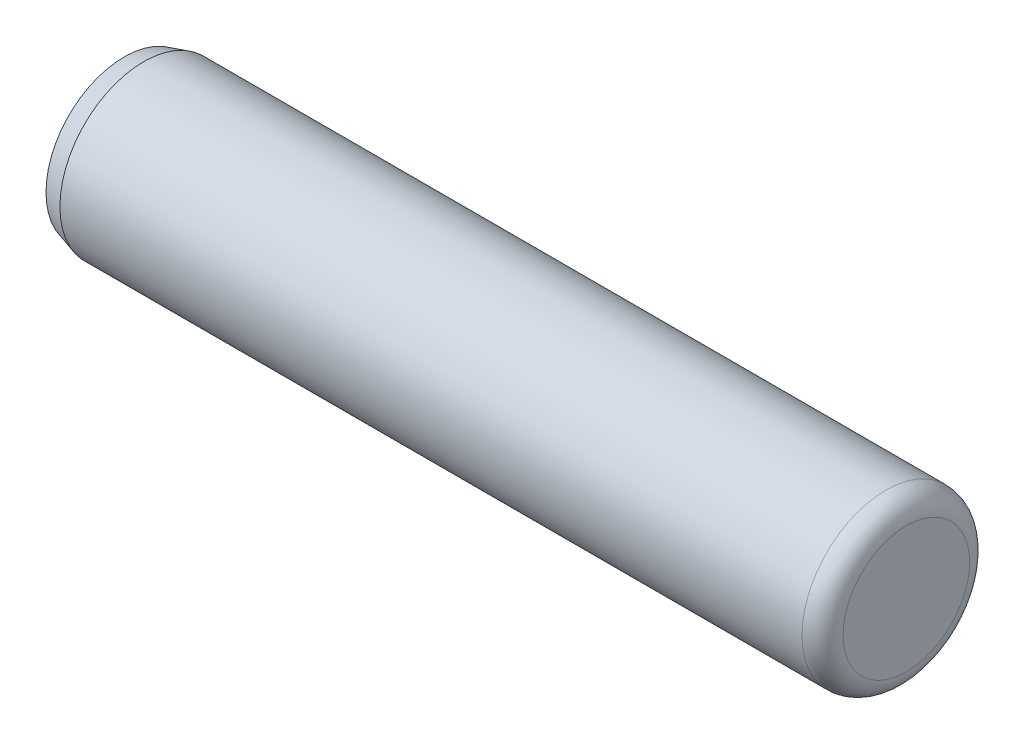
ISO-10303-21;
HEADER;
FILE_DESCRIPTION(('STEP AP214'),'2;1');
FILE_NAME('part.step','',(''),(''),'','','');
FILE_SCHEMA(('AUTOMOTIVE_DESIGN { 1 0 10303 214 1 1 1 1 }'));
ENDSEC;
DATA;
#1=APPLICATION_CONTEXT('core data for automotive mechanical design processes');
#2=APPLICATION_PROTOCOL_DEFINITION('international standard','automotive_design',2000,#1);
#3=PRODUCT_CONTEXT('',#1,'mechanical');
#4=PRODUCT('Part','Part','',(#3));
#5=PRODUCT_RELATED_PRODUCT_CATEGORY('part','',(#4));
#6=PRODUCT_DEFINITION_FORMATION('','',#4);
#7=PRODUCT_DEFINITION_CONTEXT('part definition',#1,'design');
#8=PRODUCT_DEFINITION('design','',#6,#7);
#9=PRODUCT_DEFINITION_SHAPE('','',#8);
#10=(LENGTH_UNIT() NAMED_UNIT(*) SI_UNIT(.MILLI.,.METRE.));
#11=(NAMED_UNIT(*) PLANE_ANGLE_UNIT() SI_UNIT($,.RADIAN.));
#12=(NAMED_UNIT(*) SI_UNIT($,.STERADIAN.) SOLID_ANGLE_UNIT());
#13=UNCERTAINTY_MEASURE_WITH_UNIT(LENGTH_MEASURE(1.E-05),#10,'distance_accuracy_value','');
#14=(GEOMETRIC_REPRESENTATION_CONTEXT(3) GLOBAL_UNCERTAINTY_ASSIGNED_CONTEXT((#13)) GLOBAL_UNIT_ASSIGNED_CONTEXT((#10,
#11,#12)) REPRESENTATION_CONTEXT('',''));
#15=CARTESIAN_POINT('',(0.,0.,0.));
#16=DIRECTION('',(0.,0.,1.));
#17=DIRECTION('',(1.,0.,0.));
#18=AXIS2_PLACEMENT_3D('',#15,#16,#17);
#19=CARTESIAN_POINT('',(10.5283,0.,0.));
#20=DIRECTION('',(-1.,0.,0.));
#21=DIRECTION('',(0.,0.,1.));
#22=AXIS2_PLACEMENT_3D('',#19,#20,#21);
#23=TOROIDAL_SURFACE('',#22,1.79705,0.5842);
#24=CARTESIAN_POINT('',(10.5283,0.,0.));
#25=DIRECTION('',(-1.,0.,0.));
#26=DIRECTION('',(0.,0.,1.));
#27=AXIS2_PLACEMENT_3D('',#24,#25,#26);
#28=CIRCLE('',#27,2.38125);
#29=CARTESIAN_POINT('',(10.5283,0.,2.38125));
#30=VERTEX_POINT('',#29);
#31=EDGE_CURVE('E10',#30,#30,#28,.T.);
#32=ORIENTED_EDGE('',*,*,#31,.F.);
#33=EDGE_LOOP('',(#32));
#34=FACE_BOUND('',#33,.T.);
#35=CARTESIAN_POINT('',(11.1125,0.,0.));
#36=DIRECTION('',(-1.,0.,0.));
#37=DIRECTION('',(0.,0.,1.));
#38=AXIS2_PLACEMENT_3D('',#35,#36,#37);
#39=CIRCLE('',#38,1.79705);
#40=CARTESIAN_POINT('',(11.1125,0.,1.79705));
#41=VERTEX_POINT('',#40);
#42=EDGE_CURVE('E46',#41,#41,#39,.T.);
#43=ORIENTED_EDGE('',*,*,#42,.T.);
#44=EDGE_LOOP('',(#43));
#45=FACE_BOUND('',#44,.T.);
#46=ADVANCED_FACE('F32',(#34,#45),#23,.T.);
#47=CARTESIAN_POINT('',(-11.1125,0.,0.));
#48=DIRECTION('',(-1.,0.,0.));
#49=DIRECTION('',(0.,0.,1.));
#50=AXIS2_PLACEMENT_3D('',#47,#48,#49);
#51=CYLINDRICAL_SURFACE('',#50,2.38125);
#52=CARTESIAN_POINT('',(-10.5588729570403,0.,0.));
#53=DIRECTION('',(-1.,0.,0.));
#54=DIRECTION('',(0.,0.,1.));
#55=AXIS2_PLACEMENT_3D('',#52,#53,#54);
#56=CIRCLE('',#55,2.38125);
#57=CARTESIAN_POINT('',(-10.5588729570403,0.,2.38125));
#58=VERTEX_POINT('',#57);
#59=EDGE_CURVE('E38',#58,#58,#56,.T.);
#60=ORIENTED_EDGE('',*,*,#59,.F.);
#61=EDGE_LOOP('',(#60));
#62=FACE_BOUND('',#61,.T.);
#63=ORIENTED_EDGE('',*,*,#31,.T.);
#64=EDGE_LOOP('',(#63));
#65=FACE_BOUND('',#64,.T.);
#66=ADVANCED_FACE('F64',(#62,#65),#51,.T.);
#67=CARTESIAN_POINT('',(-10.5588729570403,0.,0.));
#68=DIRECTION('',(1.,0.,0.));
#69=DIRECTION('',(0.,0.,-1.));
#70=AXIS2_PLACEMENT_3D('',#67,#68,#69);
#71=CONICAL_SURFACE('',#70,2.38125,0.279252680319094);
#72=CARTESIAN_POINT('',(-11.1125,0.,0.));
#73=DIRECTION('',(-1.,0.,0.));
#74=DIRECTION('',(0.,0.,1.));
#75=AXIS2_PLACEMENT_3D('',#72,#73,#74);
#76=CIRCLE('',#75,2.2225);
#77=CARTESIAN_POINT('',(-11.1125,0.,2.2225));
#78=VERTEX_POINT('',#77);
#79=EDGE_CURVE('E42',#78,#78,#76,.T.);
#80=ORIENTED_EDGE('',*,*,#79,.F.);
#81=EDGE_LOOP('',(#80));
#82=FACE_BOUND('',#81,.T.);
#83=ORIENTED_EDGE('',*,*,#59,.T.);
#84=EDGE_LOOP('',(#83));
#85=FACE_BOUND('',#84,.T.);
#86=ADVANCED_FACE('F60',(#82,#85),#71,.T.);
#87=CARTESIAN_POINT('',(-11.1125,2.2225,0.));
#88=DIRECTION('',(1.,0.,0.));
#89=DIRECTION('',(0.,0.,-1.));
#90=AXIS2_PLACEMENT_3D('',#87,#88,#89);
#91=PLANE('',#90);
#92=ORIENTED_EDGE('',*,*,#79,.T.);
#93=EDGE_LOOP('',(#92));
#94=FACE_BOUND('',#93,.T.);
#95=ADVANCED_FACE('F55',(#94),#91,.F.);
#96=CARTESIAN_POINT('',(11.1125,1.79705,0.));
#97=DIRECTION('',(-1.,0.,0.));
#98=DIRECTION('',(0.,0.,1.));
#99=AXIS2_PLACEMENT_3D('',#96,#97,#98);
#100=PLANE('',#99);
#101=ORIENTED_EDGE('',*,*,#42,.F.);
#102=EDGE_LOOP('',(#101));
#103=FACE_BOUND('',#102,.T.);
#104=ADVANCED_FACE('F53',(#103),#100,.F.);
#105=CLOSED_SHELL('',(#46,#66,#86,#95,#104));
#106=MANIFOLD_SOLID_BREP('B2',#105);
#107=ADVANCED_BREP_SHAPE_REPRESENTATION('',(#18,#106),#14);
#108=SHAPE_DEFINITION_REPRESENTATION(#9,#107);
ENDSEC;
END-ISO-10303-21;
